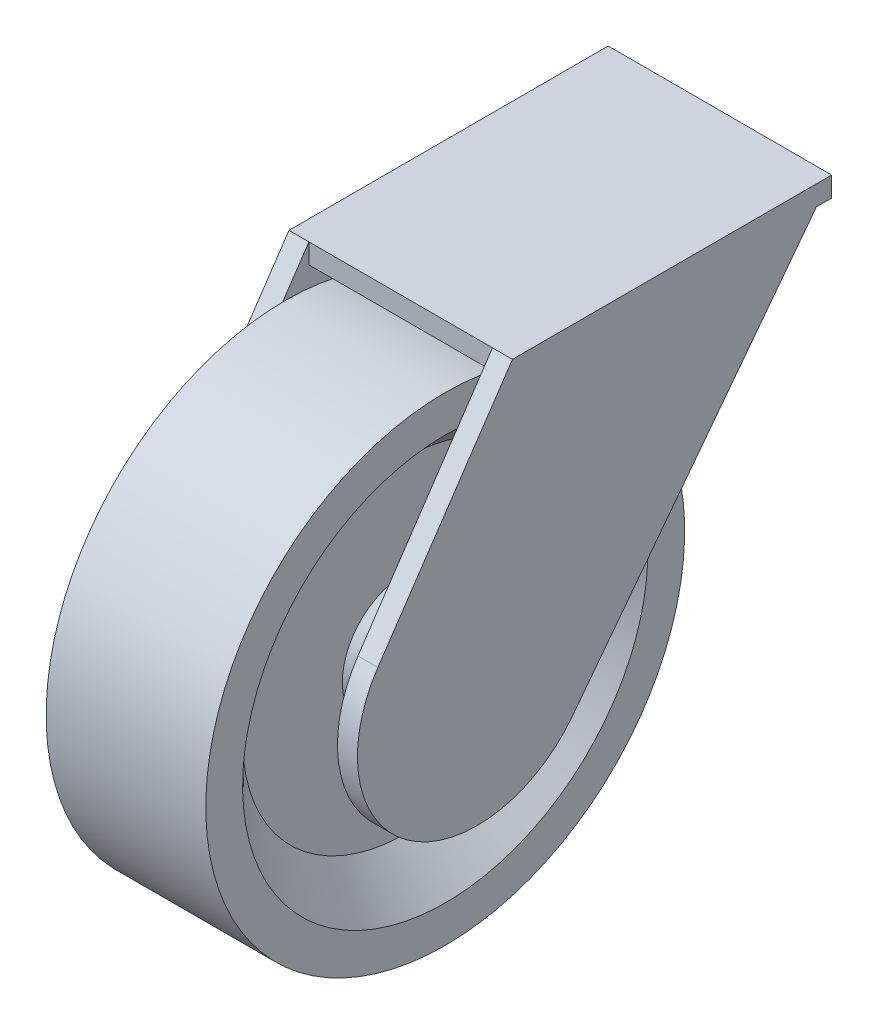
ISO-10303-21;
HEADER;
FILE_DESCRIPTION(('STEP AP214'),'2;1');
FILE_NAME('part.step','',(''),(''),'','','');
FILE_SCHEMA(('AUTOMOTIVE_DESIGN { 1 0 10303 214 1 1 1 1 }'));
ENDSEC;
DATA;
#1=APPLICATION_CONTEXT('core data for automotive mechanical design processes');
#2=APPLICATION_PROTOCOL_DEFINITION('international standard','automotive_design',2000,#1);
#3=PRODUCT_CONTEXT('',#1,'mechanical');
#4=PRODUCT('Part','Part','',(#3));
#5=PRODUCT_RELATED_PRODUCT_CATEGORY('part','',(#4));
#6=PRODUCT_DEFINITION_FORMATION('','',#4);
#7=PRODUCT_DEFINITION_CONTEXT('part definition',#1,'design');
#8=PRODUCT_DEFINITION('design','',#6,#7);
#9=PRODUCT_DEFINITION_SHAPE('','',#8);
#10=(LENGTH_UNIT() NAMED_UNIT(*) SI_UNIT(.MILLI.,.METRE.));
#11=(NAMED_UNIT(*) PLANE_ANGLE_UNIT() SI_UNIT($,.RADIAN.));
#12=(NAMED_UNIT(*) SI_UNIT($,.STERADIAN.) SOLID_ANGLE_UNIT());
#13=UNCERTAINTY_MEASURE_WITH_UNIT(LENGTH_MEASURE(1.E-05),#10,'distance_accuracy_value','');
#14=(GEOMETRIC_REPRESENTATION_CONTEXT(3) GLOBAL_UNCERTAINTY_ASSIGNED_CONTEXT((#13)) GLOBAL_UNIT_ASSIGNED_CONTEXT((#10,
#11,#12)) REPRESENTATION_CONTEXT('',''));
#15=CARTESIAN_POINT('',(0.,0.,0.));
#16=DIRECTION('',(0.,0.,1.));
#17=DIRECTION('',(1.,0.,0.));
#18=AXIS2_PLACEMENT_3D('',#15,#16,#17);
#19=CARTESIAN_POINT('',(3.00000000000001,66.7734196636378,-88.8457778702147));
#20=DIRECTION('',(0.,-0.607552677878739,-0.794279386363749));
#21=DIRECTION('',(0.,0.794279386363749,-0.607552677878739));
#22=AXIS2_PLACEMENT_3D('',#19,#20,#21);
#23=PLANE('',#22);
#24=DIRECTION('',(0.,0.794279386363749,-0.607552677878739));
#25=VECTOR('',#24,1.);
#26=CARTESIAN_POINT('',(3.00000000000001,66.7734196636378,-88.8457778702147));
#27=LINE('',#26,#25);
#28=CARTESIAN_POINT('',(3.,-18.2265803363622,-23.8283815909124));
#29=VERTEX_POINT('',#28);
#30=CARTESIAN_POINT('',(3.00000000000001,61.7734196636378,-85.0212251479028));
#31=VERTEX_POINT('',#30);
#32=EDGE_CURVE('E203',#29,#31,#27,.T.);
#33=ORIENTED_EDGE('',*,*,#32,.T.);
#34=DIRECTION('',(1.,0.,0.));
#35=VECTOR('',#34,1.);
#36=CARTESIAN_POINT('',(3.00000000000001,61.7734196636378,-85.0212251479028));
#37=LINE('',#36,#35);
#38=CARTESIAN_POINT('',(8.,61.7734196636378,-85.0212251479028));
#39=VERTEX_POINT('',#38);
#40=EDGE_CURVE('E160',#31,#39,#37,.T.);
#41=ORIENTED_EDGE('',*,*,#40,.T.);
#42=DIRECTION('',(0.,0.794279386363749,-0.607552677878739));
#43=VECTOR('',#42,1.);
#44=CARTESIAN_POINT('',(8.00000000000001,66.7734196636378,-88.8457778702147));
#45=LINE('',#44,#43);
#46=CARTESIAN_POINT('',(8.,-18.2265803363622,-23.8283815909124));
#47=VERTEX_POINT('',#46);
#48=EDGE_CURVE('E130',#47,#39,#45,.T.);
#49=ORIENTED_EDGE('',*,*,#48,.F.);
#50=DIRECTION('',(1.,0.,0.));
#51=VECTOR('',#50,1.);
#52=CARTESIAN_POINT('',(3.,-18.2265803363622,-23.8283815909124));
#53=LINE('',#52,#51);
#54=EDGE_CURVE('E217',#29,#47,#53,.T.);
#55=ORIENTED_EDGE('',*,*,#54,.F.);
#56=EDGE_LOOP('',(#33,#41,#49,#55));
#57=FACE_BOUND('',#56,.T.);
#58=ADVANCED_FACE('F38',(#57),#23,.T.);
#59=CARTESIAN_POINT('',(-43.,66.7734196636378,-88.8457778702147));
#60=DIRECTION('',(0.,0.607552677878739,0.794279386363749));
#61=DIRECTION('',(0.,-0.794279386363749,0.607552677878739));
#62=AXIS2_PLACEMENT_3D('',#59,#60,#61);
#63=PLANE('',#62);
#64=DIRECTION('',(-1.,0.,0.));
#65=VECTOR('',#64,1.);
#66=CARTESIAN_POINT('',(-43.,61.7734196636378,-85.0212251479028));
#67=LINE('',#66,#65);
#68=CARTESIAN_POINT('',(-43.,61.7734196636378,-85.0212251479028));
#69=VERTEX_POINT('',#68);
#70=CARTESIAN_POINT('',(-48.,61.7734196636378,-85.0212251479028));
#71=VERTEX_POINT('',#70);
#72=EDGE_CURVE('E61',#69,#71,#67,.T.);
#73=ORIENTED_EDGE('',*,*,#72,.F.);
#74=DIRECTION('',(0.,0.794279386363749,-0.607552677878739));
#75=VECTOR('',#74,1.);
#76=CARTESIAN_POINT('',(-43.,66.7734196636378,-88.8457778702147));
#77=LINE('',#76,#75);
#78=CARTESIAN_POINT('',(-43.,-18.2265803363622,-23.8283815909124));
#79=VERTEX_POINT('',#78);
#80=EDGE_CURVE('E171',#79,#69,#77,.T.);
#81=ORIENTED_EDGE('',*,*,#80,.F.);
#82=DIRECTION('',(-1.,0.,0.));
#83=VECTOR('',#82,1.);
#84=CARTESIAN_POINT('',(-43.,-18.2265803363622,-23.8283815909124));
#85=LINE('',#84,#83);
#86=CARTESIAN_POINT('',(-48.,-18.2265803363622,-23.8283815909124));
#87=VERTEX_POINT('',#86);
#88=EDGE_CURVE('E188',#79,#87,#85,.T.);
#89=ORIENTED_EDGE('',*,*,#88,.T.);
#90=DIRECTION('',(0.,0.794279386363749,-0.607552677878739));
#91=VECTOR('',#90,1.);
#92=CARTESIAN_POINT('',(-48.,66.7734196636378,-88.8457778702147));
#93=LINE('',#92,#91);
#94=EDGE_CURVE('E181',#87,#71,#93,.T.);
#95=ORIENTED_EDGE('',*,*,#94,.T.);
#96=EDGE_LOOP('',(#73,#81,#89,#95));
#97=FACE_BOUND('',#96,.T.);
#98=ADVANCED_FACE('F275',(#97),#63,.F.);
#99=CARTESIAN_POINT('',(-40.,60.,0.));
#100=DIRECTION('',(-1.,0.,0.));
#101=DIRECTION('',(0.,-1.,0.));
#102=AXIS2_PLACEMENT_3D('',#99,#100,#101);
#103=PLANE('',#102);
#104=CARTESIAN_POINT('',(-40.,0.,0.));
#105=DIRECTION('',(1.,0.,0.));
#106=DIRECTION('',(0.,1.,0.));
#107=AXIS2_PLACEMENT_3D('',#104,#105,#106);
#108=CIRCLE('',#107,50.7735026918962);
#109=CARTESIAN_POINT('',(-40.,50.7735026918962,0.));
#110=VERTEX_POINT('',#109);
#111=EDGE_CURVE('E223',#110,#110,#108,.T.);
#112=ORIENTED_EDGE('',*,*,#111,.T.);
#113=EDGE_LOOP('',(#112));
#114=FACE_BOUND('',#113,.T.);
#115=CARTESIAN_POINT('',(-40.,0.,0.));
#116=DIRECTION('',(1.,0.,0.));
#117=DIRECTION('',(0.,1.,0.));
#118=AXIS2_PLACEMENT_3D('',#115,#116,#117);
#119=CIRCLE('',#118,60.);
#120=CARTESIAN_POINT('',(-40.,60.,0.));
#121=VERTEX_POINT('',#120);
#122=EDGE_CURVE('E222',#121,#121,#119,.T.);
#123=ORIENTED_EDGE('',*,*,#122,.F.);
#124=EDGE_LOOP('',(#123));
#125=FACE_BOUND('',#124,.T.);
#126=ADVANCED_FACE('F40',(#114,#125),#103,.T.);
#127=CARTESIAN_POINT('',(0.,0.,0.));
#128=DIRECTION('',(1.,0.,0.));
#129=DIRECTION('',(0.,1.,0.));
#130=AXIS2_PLACEMENT_3D('',#127,#128,#129);
#131=CYLINDRICAL_SURFACE('',#130,60.);
#132=ORIENTED_EDGE('',*,*,#122,.T.);
#133=EDGE_LOOP('',(#132));
#134=FACE_BOUND('',#133,.T.);
#135=CARTESIAN_POINT('',(0.,0.,0.));
#136=DIRECTION('',(1.,0.,0.));
#137=DIRECTION('',(0.,1.,0.));
#138=AXIS2_PLACEMENT_3D('',#135,#136,#137);
#139=CIRCLE('',#138,60.);
#140=CARTESIAN_POINT('',(0.,60.,0.));
#141=VERTEX_POINT('',#140);
#142=EDGE_CURVE('E247',#141,#141,#139,.T.);
#143=ORIENTED_EDGE('',*,*,#142,.F.);
#144=EDGE_LOOP('',(#143));
#145=FACE_BOUND('',#144,.T.);
#146=ADVANCED_FACE('F323',(#134,#145),#131,.T.);
#147=CARTESIAN_POINT('',(0.,60.,0.));
#148=DIRECTION('',(1.,0.,0.));
#149=DIRECTION('',(0.,1.,0.));
#150=AXIS2_PLACEMENT_3D('',#147,#148,#149);
#151=PLANE('',#150);
#152=ORIENTED_EDGE('',*,*,#142,.T.);
#153=EDGE_LOOP('',(#152));
#154=FACE_BOUND('',#153,.T.);
#155=CARTESIAN_POINT('',(0.,0.,0.));
#156=DIRECTION('',(1.,0.,0.));
#157=DIRECTION('',(0.,1.,0.));
#158=AXIS2_PLACEMENT_3D('',#155,#156,#157);
#159=CIRCLE('',#158,50.7735026918962);
#160=CARTESIAN_POINT('',(0.,50.7735026918962,0.));
#161=VERTEX_POINT('',#160);
#162=EDGE_CURVE('E244',#161,#161,#159,.T.);
#163=ORIENTED_EDGE('',*,*,#162,.F.);
#164=EDGE_LOOP('',(#163));
#165=FACE_BOUND('',#164,.T.);
#166=ADVANCED_FACE('F320',(#154,#165),#151,.T.);
#167=CARTESIAN_POINT('',(-10.,0.,0.));
#168=DIRECTION('',(1.,0.,0.));
#169=DIRECTION('',(0.,1.,0.));
#170=AXIS2_PLACEMENT_3D('',#167,#168,#169);
#171=CONICAL_SURFACE('',#170,40.7735026918962,0.785398163397447);
#172=ORIENTED_EDGE('',*,*,#162,.T.);
#173=EDGE_LOOP('',(#172));
#174=FACE_BOUND('',#173,.T.);
#175=CARTESIAN_POINT('',(-10.,0.,0.));
#176=DIRECTION('',(1.,0.,0.));
#177=DIRECTION('',(0.,1.,0.));
#178=AXIS2_PLACEMENT_3D('',#175,#176,#177);
#179=CIRCLE('',#178,40.7735026918962);
#180=CARTESIAN_POINT('',(-10.,40.7735026918962,0.));
#181=VERTEX_POINT('',#180);
#182=EDGE_CURVE('E241',#181,#181,#179,.T.);
#183=ORIENTED_EDGE('',*,*,#182,.F.);
#184=EDGE_LOOP('',(#183));
#185=FACE_BOUND('',#184,.T.);
#186=ADVANCED_FACE('F316',(#174,#185),#171,.F.);
#187=CARTESIAN_POINT('',(-10.,40.7735026918962,0.));
#188=DIRECTION('',(1.,0.,0.));
#189=DIRECTION('',(0.,1.,0.));
#190=AXIS2_PLACEMENT_3D('',#187,#188,#189);
#191=PLANE('',#190);
#192=ORIENTED_EDGE('',*,*,#182,.T.);
#193=EDGE_LOOP('',(#192));
#194=FACE_BOUND('',#193,.T.);
#195=CARTESIAN_POINT('',(-10.,0.,0.));
#196=DIRECTION('',(1.,0.,0.));
#197=DIRECTION('',(0.,1.,0.));
#198=AXIS2_PLACEMENT_3D('',#195,#196,#197);
#199=CIRCLE('',#198,15.7735026918962);
#200=CARTESIAN_POINT('',(-10.,15.7735026918962,0.));
#201=VERTEX_POINT('',#200);
#202=EDGE_CURVE('E238',#201,#201,#199,.T.);
#203=ORIENTED_EDGE('',*,*,#202,.F.);
#204=EDGE_LOOP('',(#203));
#205=FACE_BOUND('',#204,.T.);
#206=ADVANCED_FACE('F312',(#194,#205),#191,.T.);
#207=CARTESIAN_POINT('',(0.,0.,0.));
#208=DIRECTION('',(-1.,0.,0.));
#209=DIRECTION('',(0.,-1.,0.));
#210=AXIS2_PLACEMENT_3D('',#207,#208,#209);
#211=CONICAL_SURFACE('',#210,10.,0.523598775598296);
#212=ORIENTED_EDGE('',*,*,#202,.T.);
#213=EDGE_LOOP('',(#212));
#214=FACE_BOUND('',#213,.T.);
#215=CARTESIAN_POINT('',(0.,0.,0.));
#216=DIRECTION('',(1.,0.,0.));
#217=DIRECTION('',(0.,1.,0.));
#218=AXIS2_PLACEMENT_3D('',#215,#216,#217);
#219=CIRCLE('',#218,10.);
#220=CARTESIAN_POINT('',(0.,10.,0.));
#221=VERTEX_POINT('',#220);
#222=EDGE_CURVE('E235',#221,#221,#219,.T.);
#223=ORIENTED_EDGE('',*,*,#222,.F.);
#224=EDGE_LOOP('',(#223));
#225=FACE_BOUND('',#224,.T.);
#226=ADVANCED_FACE('F308',(#214,#225),#211,.T.);
#227=CARTESIAN_POINT('',(0.,10.,0.));
#228=DIRECTION('',(1.,0.,0.));
#229=DIRECTION('',(0.,1.,0.));
#230=AXIS2_PLACEMENT_3D('',#227,#228,#229);
#231=PLANE('',#230);
#232=CARTESIAN_POINT('',(0.,0.,0.));
#233=DIRECTION('',(1.,0.,0.));
#234=DIRECTION('',(0.,1.,0.));
#235=AXIS2_PLACEMENT_3D('',#232,#233,#234);
#236=CIRCLE('',#235,7.5);
#237=CARTESIAN_POINT('',(0.,7.5,0.));
#238=VERTEX_POINT('',#237);
#239=EDGE_CURVE('E46',#238,#238,#236,.T.);
#240=ORIENTED_EDGE('',*,*,#239,.F.);
#241=EDGE_LOOP('',(#240));
#242=FACE_BOUND('',#241,.T.);
#243=ORIENTED_EDGE('',*,*,#222,.T.);
#244=EDGE_LOOP('',(#243));
#245=FACE_BOUND('',#244,.T.);
#246=ADVANCED_FACE('F304',(#242,#245),#231,.T.);
#247=CARTESIAN_POINT('',(-40.,10.,0.));
#248=DIRECTION('',(-1.,0.,0.));
#249=DIRECTION('',(0.,-1.,0.));
#250=AXIS2_PLACEMENT_3D('',#247,#248,#249);
#251=PLANE('',#250);
#252=CARTESIAN_POINT('',(-40.,0.,0.));
#253=DIRECTION('',(1.,0.,0.));
#254=DIRECTION('',(0.,1.,0.));
#255=AXIS2_PLACEMENT_3D('',#252,#253,#254);
#256=CIRCLE('',#255,7.5);
#257=CARTESIAN_POINT('',(-40.,7.50000000000001,0.));
#258=VERTEX_POINT('',#257);
#259=EDGE_CURVE('E187',#258,#258,#256,.T.);
#260=ORIENTED_EDGE('',*,*,#259,.T.);
#261=EDGE_LOOP('',(#260));
#262=FACE_BOUND('',#261,.T.);
#263=CARTESIAN_POINT('',(-40.,0.,0.));
#264=DIRECTION('',(1.,0.,0.));
#265=DIRECTION('',(0.,1.,0.));
#266=AXIS2_PLACEMENT_3D('',#263,#264,#265);
#267=CIRCLE('',#266,9.99999999999999);
#268=CARTESIAN_POINT('',(-40.,10.,0.));
#269=VERTEX_POINT('',#268);
#270=EDGE_CURVE('E232',#269,#269,#267,.T.);
#271=ORIENTED_EDGE('',*,*,#270,.F.);
#272=EDGE_LOOP('',(#271));
#273=FACE_BOUND('',#272,.T.);
#274=ADVANCED_FACE('F300',(#262,#273),#251,.T.);
#275=CARTESIAN_POINT('',(-30.,0.,0.));
#276=DIRECTION('',(1.,0.,0.));
#277=DIRECTION('',(0.,1.,0.));
#278=AXIS2_PLACEMENT_3D('',#275,#276,#277);
#279=CONICAL_SURFACE('',#278,15.7735026918962,0.523598775598296);
#280=ORIENTED_EDGE('',*,*,#270,.T.);
#281=EDGE_LOOP('',(#280));
#282=FACE_BOUND('',#281,.T.);
#283=CARTESIAN_POINT('',(-30.,0.,0.));
#284=DIRECTION('',(1.,0.,0.));
#285=DIRECTION('',(0.,1.,0.));
#286=AXIS2_PLACEMENT_3D('',#283,#284,#285);
#287=CIRCLE('',#286,15.7735026918962);
#288=CARTESIAN_POINT('',(-30.,15.7735026918962,0.));
#289=VERTEX_POINT('',#288);
#290=EDGE_CURVE('E229',#289,#289,#287,.T.);
#291=ORIENTED_EDGE('',*,*,#290,.F.);
#292=EDGE_LOOP('',(#291));
#293=FACE_BOUND('',#292,.T.);
#294=ADVANCED_FACE('F296',(#282,#293),#279,.T.);
#295=CARTESIAN_POINT('',(-30.,40.7735026918962,0.));
#296=DIRECTION('',(-1.,0.,0.));
#297=DIRECTION('',(0.,-1.,0.));
#298=AXIS2_PLACEMENT_3D('',#295,#296,#297);
#299=PLANE('',#298);
#300=ORIENTED_EDGE('',*,*,#290,.T.);
#301=EDGE_LOOP('',(#300));
#302=FACE_BOUND('',#301,.T.);
#303=CARTESIAN_POINT('',(-30.,0.,0.));
#304=DIRECTION('',(1.,0.,0.));
#305=DIRECTION('',(0.,1.,0.));
#306=AXIS2_PLACEMENT_3D('',#303,#304,#305);
#307=CIRCLE('',#306,40.7735026918962);
#308=CARTESIAN_POINT('',(-30.,40.7735026918962,0.));
#309=VERTEX_POINT('',#308);
#310=EDGE_CURVE('E226',#309,#309,#307,.T.);
#311=ORIENTED_EDGE('',*,*,#310,.F.);
#312=EDGE_LOOP('',(#311));
#313=FACE_BOUND('',#312,.T.);
#314=ADVANCED_FACE('F292',(#302,#313),#299,.T.);
#315=CARTESIAN_POINT('',(-40.,0.,0.));
#316=DIRECTION('',(-1.,0.,0.));
#317=DIRECTION('',(0.,-1.,0.));
#318=AXIS2_PLACEMENT_3D('',#315,#316,#317);
#319=CONICAL_SURFACE('',#318,50.7735026918962,0.785398163397447);
#320=ORIENTED_EDGE('',*,*,#310,.T.);
#321=EDGE_LOOP('',(#320));
#322=FACE_BOUND('',#321,.T.);
#323=ORIENTED_EDGE('',*,*,#111,.F.);
#324=EDGE_LOOP('',(#323));
#325=FACE_BOUND('',#324,.T.);
#326=ADVANCED_FACE('F289',(#322,#325),#319,.F.);
#327=CARTESIAN_POINT('',(8.,0.,0.));
#328=DIRECTION('',(-1.,0.,0.));
#329=DIRECTION('',(0.,-1.,0.));
#330=AXIS2_PLACEMENT_3D('',#327,#328,#329);
#331=CYLINDRICAL_SURFACE('',#330,7.5);
#332=CARTESIAN_POINT('',(3.,0.,0.));
#333=DIRECTION('',(-1.,0.,0.));
#334=DIRECTION('',(0.,-1.,0.));
#335=AXIS2_PLACEMENT_3D('',#332,#333,#334);
#336=CIRCLE('',#335,7.5);
#337=CARTESIAN_POINT('',(3.,-7.5,0.));
#338=VERTEX_POINT('',#337);
#339=EDGE_CURVE('E215',#338,#338,#336,.T.);
#340=ORIENTED_EDGE('',*,*,#339,.T.);
#341=EDGE_LOOP('',(#340));
#342=FACE_BOUND('',#341,.T.);
#343=ORIENTED_EDGE('',*,*,#239,.T.);
#344=EDGE_LOOP('',(#343));
#345=FACE_BOUND('',#344,.T.);
#346=ADVANCED_FACE('F254',(#342,#345),#331,.T.);
#347=CARTESIAN_POINT('',(3.,16.7734196636378,24.872723871492));
#348=DIRECTION('',(0.,0.559113988787928,0.8290907957164));
#349=DIRECTION('',(0.,-0.8290907957164,0.559113988787928));
#350=AXIS2_PLACEMENT_3D('',#347,#348,#349);
#351=PLANE('',#350);
#352=DIRECTION('',(0.,-0.8290907957164,0.559113988787928));
#353=VECTOR('',#352,1.);
#354=CARTESIAN_POINT('',(8.,16.7734196636378,24.872723871492));
#355=LINE('',#354,#353);
#356=CARTESIAN_POINT('',(8.00000000000001,66.7734196636378,-8.84577787021469));
#357=VERTEX_POINT('',#356);
#358=CARTESIAN_POINT('',(8.,16.7734196636378,24.872723871492));
#359=VERTEX_POINT('',#358);
#360=EDGE_CURVE('E195',#357,#359,#355,.T.);
#361=ORIENTED_EDGE('',*,*,#360,.F.);
#362=DIRECTION('',(1.,0.,0.));
#363=VECTOR('',#362,1.);
#364=CARTESIAN_POINT('',(3.00000000000001,66.7734196636378,-8.84577787021469));
#365=LINE('',#364,#363);
#366=CARTESIAN_POINT('',(3.00000000000001,66.7734196636378,-8.84577787021469));
#367=VERTEX_POINT('',#366);
#368=EDGE_CURVE('E213',#367,#357,#365,.T.);
#369=ORIENTED_EDGE('',*,*,#368,.F.);
#370=DIRECTION('',(0.,-0.8290907957164,0.559113988787928));
#371=VECTOR('',#370,1.);
#372=CARTESIAN_POINT('',(3.,16.7734196636378,24.872723871492));
#373=LINE('',#372,#371);
#374=CARTESIAN_POINT('',(3.,16.7734196636378,24.872723871492));
#375=VERTEX_POINT('',#374);
#376=EDGE_CURVE('E196',#367,#375,#373,.T.);
#377=ORIENTED_EDGE('',*,*,#376,.T.);
#378=DIRECTION('',(1.,0.,0.));
#379=VECTOR('',#378,1.);
#380=CARTESIAN_POINT('',(3.,16.7734196636378,24.872723871492));
#381=LINE('',#380,#379);
#382=EDGE_CURVE('E206',#375,#359,#381,.T.);
#383=ORIENTED_EDGE('',*,*,#382,.T.);
#384=EDGE_LOOP('',(#361,#369,#377,#383));
#385=FACE_BOUND('',#384,.T.);
#386=ADVANCED_FACE('F283',(#385),#351,.T.);
#387=CARTESIAN_POINT('',(3.00000000000001,66.7734196636378,-8.84577787021469));
#388=DIRECTION('',(0.,1.,0.));
#389=DIRECTION('',(-1.,0.,0.));
#390=AXIS2_PLACEMENT_3D('',#387,#388,#389);
#391=PLANE('',#390);
#392=DIRECTION('',(0.,0.,1.));
#393=VECTOR('',#392,1.);
#394=CARTESIAN_POINT('',(8.00000000000001,66.7734196636378,-8.84577787021469));
#395=LINE('',#394,#393);
#396=CARTESIAN_POINT('',(8.,66.7734196636378,-88.8457778702147));
#397=VERTEX_POINT('',#396);
#398=EDGE_CURVE('E200',#397,#357,#395,.T.);
#399=ORIENTED_EDGE('',*,*,#398,.F.);
#400=DIRECTION('',(1.,0.,0.));
#401=VECTOR('',#400,1.);
#402=CARTESIAN_POINT('',(3.00000000000001,66.7734196636378,-88.8457778702147));
#403=LINE('',#402,#401);
#404=CARTESIAN_POINT('',(-48.,66.7734196636378,-88.8457778702147));
#405=VERTEX_POINT('',#404);
#406=EDGE_CURVE('E141',#405,#397,#403,.T.);
#407=ORIENTED_EDGE('',*,*,#406,.F.);
#408=DIRECTION('',(0.,0.,1.));
#409=VECTOR('',#408,1.);
#410=CARTESIAN_POINT('',(-48.,66.7734196636378,-8.84577787021469));
#411=LINE('',#410,#409);
#412=CARTESIAN_POINT('',(-48.,66.7734196636378,-8.84577787021469));
#413=VERTEX_POINT('',#412);
#414=EDGE_CURVE('E179',#405,#413,#411,.T.);
#415=ORIENTED_EDGE('',*,*,#414,.T.);
#416=DIRECTION('',(-1.,0.,0.));
#417=VECTOR('',#416,1.);
#418=CARTESIAN_POINT('',(-43.,66.7734196636378,-8.84577787021469));
#419=LINE('',#418,#417);
#420=CARTESIAN_POINT('',(-43.,66.7734196636378,-8.84577787021469));
#421=VERTEX_POINT('',#420);
#422=EDGE_CURVE('E176',#421,#413,#419,.T.);
#423=ORIENTED_EDGE('',*,*,#422,.F.);
#424=DIRECTION('',(1.,0.,0.));
#425=VECTOR('',#424,1.);
#426=CARTESIAN_POINT('',(-48.,66.7734196636378,-8.84577787021469));
#427=LINE('',#426,#425);
#428=EDGE_CURVE('E152',#421,#367,#427,.T.);
#429=ORIENTED_EDGE('',*,*,#428,.T.);
#430=ORIENTED_EDGE('',*,*,#368,.T.);
#431=EDGE_LOOP('',(#399,#407,#415,#423,#429,#430));
#432=FACE_BOUND('',#431,.T.);
#433=ADVANCED_FACE('F268',(#432),#391,.T.);
#434=CARTESIAN_POINT('',(3.,0.,0.));
#435=DIRECTION('',(1.,0.,0.));
#436=DIRECTION('',(0.,1.,0.));
#437=AXIS2_PLACEMENT_3D('',#434,#435,#436);
#438=CYLINDRICAL_SURFACE('',#437,30.);
#439=CARTESIAN_POINT('',(8.,0.,0.));
#440=DIRECTION('',(1.,0.,0.));
#441=DIRECTION('',(0.,-1.,0.));
#442=AXIS2_PLACEMENT_3D('',#439,#440,#441);
#443=CIRCLE('',#442,30.);
#444=EDGE_CURVE('E209',#359,#47,#443,.T.);
#445=ORIENTED_EDGE('',*,*,#444,.F.);
#446=ORIENTED_EDGE('',*,*,#382,.F.);
#447=CARTESIAN_POINT('',(3.,0.,0.));
#448=DIRECTION('',(1.,0.,0.));
#449=DIRECTION('',(0.,-1.,0.));
#450=AXIS2_PLACEMENT_3D('',#447,#448,#449);
#451=CIRCLE('',#450,30.);
#452=EDGE_CURVE('E199',#375,#29,#451,.T.);
#453=ORIENTED_EDGE('',*,*,#452,.T.);
#454=ORIENTED_EDGE('',*,*,#54,.T.);
#455=EDGE_LOOP('',(#445,#446,#453,#454));
#456=FACE_BOUND('',#455,.T.);
#457=ADVANCED_FACE('F259',(#456),#438,.T.);
#458=CARTESIAN_POINT('',(3.,0.,0.));
#459=DIRECTION('',(-1.,0.,0.));
#460=DIRECTION('',(0.,-1.,0.));
#461=AXIS2_PLACEMENT_3D('',#458,#459,#460);
#462=PLANE('',#461);
#463=DIRECTION('',(0.,1.,0.));
#464=VECTOR('',#463,1.);
#465=CARTESIAN_POINT('',(3.,0.,-8.84577787021469));
#466=LINE('',#465,#464);
#467=CARTESIAN_POINT('',(3.00000000000001,61.7734196636378,-8.84577787021469));
#468=VERTEX_POINT('',#467);
#469=EDGE_CURVE('E164',#468,#367,#466,.T.);
#470=ORIENTED_EDGE('',*,*,#469,.F.);
#471=DIRECTION('',(0.,0.,-1.));
#472=VECTOR('',#471,1.);
#473=CARTESIAN_POINT('',(3.00000000000001,61.7734196636378,0.));
#474=LINE('',#473,#472);
#475=EDGE_CURVE('E157',#468,#31,#474,.T.);
#476=ORIENTED_EDGE('',*,*,#475,.T.);
#477=ORIENTED_EDGE('',*,*,#32,.F.);
#478=ORIENTED_EDGE('',*,*,#452,.F.);
#479=ORIENTED_EDGE('',*,*,#376,.F.);
#480=EDGE_LOOP('',(#470,#476,#477,#478,#479));
#481=FACE_BOUND('',#480,.T.);
#482=ORIENTED_EDGE('',*,*,#339,.F.);
#483=EDGE_LOOP('',(#482));
#484=FACE_BOUND('',#483,.T.);
#485=ADVANCED_FACE('F257',(#481,#484),#462,.T.);
#486=CARTESIAN_POINT('',(8.,0.,0.));
#487=DIRECTION('',(1.,0.,0.));
#488=DIRECTION('',(0.,1.,0.));
#489=AXIS2_PLACEMENT_3D('',#486,#487,#488);
#490=PLANE('',#489);
#491=ORIENTED_EDGE('',*,*,#398,.T.);
#492=ORIENTED_EDGE('',*,*,#360,.T.);
#493=ORIENTED_EDGE('',*,*,#444,.T.);
#494=ORIENTED_EDGE('',*,*,#48,.T.);
#495=DIRECTION('',(0.,0.,-1.));
#496=VECTOR('',#495,1.);
#497=CARTESIAN_POINT('',(8.,61.7734196636378,-88.8457778702147));
#498=LINE('',#497,#496);
#499=CARTESIAN_POINT('',(8.,61.7734196636378,-88.8457778702147));
#500=VERTEX_POINT('',#499);
#501=EDGE_CURVE('E122',#39,#500,#498,.T.);
#502=ORIENTED_EDGE('',*,*,#501,.T.);
#503=DIRECTION('',(0.,1.,0.));
#504=VECTOR('',#503,1.);
#505=CARTESIAN_POINT('',(8.,61.7734196636378,-88.8457778702147));
#506=LINE('',#505,#504);
#507=EDGE_CURVE('E126',#500,#397,#506,.T.);
#508=ORIENTED_EDGE('',*,*,#507,.T.);
#509=EDGE_LOOP('',(#491,#492,#493,#494,#502,#508));
#510=FACE_BOUND('',#509,.T.);
#511=ADVANCED_FACE('F125',(#510),#490,.T.);
#512=CARTESIAN_POINT('',(-48.,0.,0.));
#513=DIRECTION('',(1.,0.,0.));
#514=DIRECTION('',(0.,1.,0.));
#515=AXIS2_PLACEMENT_3D('',#512,#513,#514);
#516=CYLINDRICAL_SURFACE('',#515,7.5);
#517=CARTESIAN_POINT('',(-43.,0.,0.));
#518=DIRECTION('',(1.,0.,0.));
#519=DIRECTION('',(0.,1.,0.));
#520=AXIS2_PLACEMENT_3D('',#517,#518,#519);
#521=CIRCLE('',#520,7.5);
#522=CARTESIAN_POINT('',(-43.,7.50000000000001,0.));
#523=VERTEX_POINT('',#522);
#524=EDGE_CURVE('E11',#523,#523,#521,.F.);
#525=ORIENTED_EDGE('',*,*,#524,.F.);
#526=EDGE_LOOP('',(#525));
#527=FACE_BOUND('',#526,.T.);
#528=ORIENTED_EDGE('',*,*,#259,.F.);
#529=EDGE_LOOP('',(#528));
#530=FACE_BOUND('',#529,.T.);
#531=ADVANCED_FACE('F266',(#527,#530),#516,.T.);
#532=CARTESIAN_POINT('',(-43.,16.7734196636378,24.872723871492));
#533=DIRECTION('',(0.,-0.559113988787928,-0.8290907957164));
#534=DIRECTION('',(0.,0.8290907957164,-0.559113988787928));
#535=AXIS2_PLACEMENT_3D('',#532,#533,#534);
#536=PLANE('',#535);
#537=DIRECTION('',(0.,-0.8290907957164,0.559113988787928));
#538=VECTOR('',#537,1.);
#539=CARTESIAN_POINT('',(-48.,16.7734196636378,24.872723871492));
#540=LINE('',#539,#538);
#541=CARTESIAN_POINT('',(-48.,16.7734196636378,24.872723871492));
#542=VERTEX_POINT('',#541);
#543=EDGE_CURVE('E167',#413,#542,#540,.T.);
#544=ORIENTED_EDGE('',*,*,#543,.T.);
#545=DIRECTION('',(-1.,0.,0.));
#546=VECTOR('',#545,1.);
#547=CARTESIAN_POINT('',(-43.,16.7734196636378,24.872723871492));
#548=LINE('',#547,#546);
#549=CARTESIAN_POINT('',(-43.,16.7734196636378,24.872723871492));
#550=VERTEX_POINT('',#549);
#551=EDGE_CURVE('E184',#550,#542,#548,.T.);
#552=ORIENTED_EDGE('',*,*,#551,.F.);
#553=DIRECTION('',(0.,-0.8290907957164,0.559113988787928));
#554=VECTOR('',#553,1.);
#555=CARTESIAN_POINT('',(-43.,16.7734196636378,24.872723871492));
#556=LINE('',#555,#554);
#557=EDGE_CURVE('E168',#421,#550,#556,.T.);
#558=ORIENTED_EDGE('',*,*,#557,.F.);
#559=ORIENTED_EDGE('',*,*,#422,.T.);
#560=EDGE_LOOP('',(#544,#552,#558,#559));
#561=FACE_BOUND('',#560,.T.);
#562=ADVANCED_FACE('F471',(#561),#536,.F.);
#563=CARTESIAN_POINT('',(-43.,0.,0.));
#564=DIRECTION('',(-1.,0.,0.));
#565=DIRECTION('',(0.,-1.,0.));
#566=AXIS2_PLACEMENT_3D('',#563,#564,#565);
#567=CYLINDRICAL_SURFACE('',#566,30.);
#568=CARTESIAN_POINT('',(-48.,0.,0.));
#569=DIRECTION('',(1.,0.,0.));
#570=DIRECTION('',(0.,-1.,0.));
#571=AXIS2_PLACEMENT_3D('',#568,#569,#570);
#572=CIRCLE('',#571,30.);
#573=EDGE_CURVE('E172',#542,#87,#572,.T.);
#574=ORIENTED_EDGE('',*,*,#573,.T.);
#575=ORIENTED_EDGE('',*,*,#88,.F.);
#576=CARTESIAN_POINT('',(-43.,0.,0.));
#577=DIRECTION('',(1.,0.,0.));
#578=DIRECTION('',(0.,-1.,0.));
#579=AXIS2_PLACEMENT_3D('',#576,#577,#578);
#580=CIRCLE('',#579,30.);
#581=EDGE_CURVE('E174',#550,#79,#580,.T.);
#582=ORIENTED_EDGE('',*,*,#581,.F.);
#583=ORIENTED_EDGE('',*,*,#551,.T.);
#584=EDGE_LOOP('',(#574,#575,#582,#583));
#585=FACE_BOUND('',#584,.T.);
#586=ADVANCED_FACE('F367',(#585),#567,.T.);
#587=CARTESIAN_POINT('',(-43.,0.,0.));
#588=DIRECTION('',(1.,0.,0.));
#589=DIRECTION('',(0.,-1.,0.));
#590=AXIS2_PLACEMENT_3D('',#587,#588,#589);
#591=PLANE('',#590);
#592=DIRECTION('',(0.,-1.,0.));
#593=VECTOR('',#592,1.);
#594=CARTESIAN_POINT('',(-43.,0.,-8.84577787021469));
#595=LINE('',#594,#593);
#596=CARTESIAN_POINT('',(-43.,61.7734196636378,-8.84577787021469));
#597=VERTEX_POINT('',#596);
#598=EDGE_CURVE('E162',#421,#597,#595,.T.);
#599=ORIENTED_EDGE('',*,*,#598,.F.);
#600=ORIENTED_EDGE('',*,*,#557,.T.);
#601=ORIENTED_EDGE('',*,*,#581,.T.);
#602=ORIENTED_EDGE('',*,*,#80,.T.);
#603=DIRECTION('',(0.,0.,1.));
#604=VECTOR('',#603,1.);
#605=CARTESIAN_POINT('',(-43.,61.7734196636378,0.));
#606=LINE('',#605,#604);
#607=EDGE_CURVE('E53',#69,#597,#606,.T.);
#608=ORIENTED_EDGE('',*,*,#607,.T.);
#609=EDGE_LOOP('',(#599,#600,#601,#602,#608));
#610=FACE_BOUND('',#609,.T.);
#611=ORIENTED_EDGE('',*,*,#524,.T.);
#612=EDGE_LOOP('',(#611));
#613=FACE_BOUND('',#612,.T.);
#614=ADVANCED_FACE('F413',(#610,#613),#591,.T.);
#615=CARTESIAN_POINT('',(-48.,0.,0.));
#616=DIRECTION('',(-1.,0.,0.));
#617=DIRECTION('',(0.,1.,0.));
#618=AXIS2_PLACEMENT_3D('',#615,#616,#617);
#619=PLANE('',#618);
#620=ORIENTED_EDGE('',*,*,#543,.F.);
#621=ORIENTED_EDGE('',*,*,#414,.F.);
#622=DIRECTION('',(0.,1.,0.));
#623=VECTOR('',#622,1.);
#624=CARTESIAN_POINT('',(-48.,61.7734196636378,-88.8457778702147));
#625=LINE('',#624,#623);
#626=CARTESIAN_POINT('',(-48.,61.7734196636378,-88.8457778702147));
#627=VERTEX_POINT('',#626);
#628=EDGE_CURVE('E143',#627,#405,#625,.T.);
#629=ORIENTED_EDGE('',*,*,#628,.F.);
#630=DIRECTION('',(0.,0.,1.));
#631=VECTOR('',#630,1.);
#632=CARTESIAN_POINT('',(-48.,61.7734196636378,-88.8457778702147));
#633=LINE('',#632,#631);
#634=EDGE_CURVE('E148',#627,#71,#633,.T.);
#635=ORIENTED_EDGE('',*,*,#634,.T.);
#636=ORIENTED_EDGE('',*,*,#94,.F.);
#637=ORIENTED_EDGE('',*,*,#573,.F.);
#638=EDGE_LOOP('',(#620,#621,#629,#635,#636,#637));
#639=FACE_BOUND('',#638,.T.);
#640=ADVANCED_FACE('F418',(#639),#619,.T.);
#641=CARTESIAN_POINT('',(0.,61.7734196636378,0.));
#642=DIRECTION('',(0.,1.,0.));
#643=DIRECTION('',(0.,0.,1.));
#644=AXIS2_PLACEMENT_3D('',#641,#642,#643);
#645=PLANE('',#644);
#646=ORIENTED_EDGE('',*,*,#40,.F.);
#647=ORIENTED_EDGE('',*,*,#475,.F.);
#648=DIRECTION('',(1.,0.,0.));
#649=VECTOR('',#648,1.);
#650=CARTESIAN_POINT('',(-48.,61.7734196636378,-8.84577787021469));
#651=LINE('',#650,#649);
#652=EDGE_CURVE('E135',#597,#468,#651,.T.);
#653=ORIENTED_EDGE('',*,*,#652,.F.);
#654=ORIENTED_EDGE('',*,*,#607,.F.);
#655=ORIENTED_EDGE('',*,*,#72,.T.);
#656=ORIENTED_EDGE('',*,*,#634,.F.);
#657=DIRECTION('',(-1.,0.,0.));
#658=VECTOR('',#657,1.);
#659=CARTESIAN_POINT('',(-48.,61.7734196636378,-88.8457778702147));
#660=LINE('',#659,#658);
#661=EDGE_CURVE('E134',#500,#627,#660,.T.);
#662=ORIENTED_EDGE('',*,*,#661,.F.);
#663=ORIENTED_EDGE('',*,*,#501,.F.);
#664=EDGE_LOOP('',(#646,#647,#653,#654,#655,#656,#662,#663));
#665=FACE_BOUND('',#664,.T.);
#666=ADVANCED_FACE('F146',(#665),#645,.F.);
#667=CARTESIAN_POINT('',(-48.,61.7734196636378,-88.8457778702147));
#668=DIRECTION('',(0.,0.,-1.));
#669=DIRECTION('',(-1.,0.,0.));
#670=AXIS2_PLACEMENT_3D('',#667,#668,#669);
#671=PLANE('',#670);
#672=ORIENTED_EDGE('',*,*,#406,.T.);
#673=ORIENTED_EDGE('',*,*,#507,.F.);
#674=ORIENTED_EDGE('',*,*,#661,.T.);
#675=ORIENTED_EDGE('',*,*,#628,.T.);
#676=EDGE_LOOP('',(#672,#673,#674,#675));
#677=FACE_BOUND('',#676,.T.);
#678=ADVANCED_FACE('F139',(#677),#671,.T.);
#679=CARTESIAN_POINT('',(-48.,61.7734196636378,-8.84577787021469));
#680=DIRECTION('',(0.,0.,1.));
#681=DIRECTION('',(1.,0.,0.));
#682=AXIS2_PLACEMENT_3D('',#679,#680,#681);
#683=PLANE('',#682);
#684=ORIENTED_EDGE('',*,*,#652,.T.);
#685=ORIENTED_EDGE('',*,*,#469,.T.);
#686=ORIENTED_EDGE('',*,*,#428,.F.);
#687=ORIENTED_EDGE('',*,*,#598,.T.);
#688=EDGE_LOOP('',(#684,#685,#686,#687));
#689=FACE_BOUND('',#688,.T.);
#690=ADVANCED_FACE('F447',(#689),#683,.T.);
#691=CLOSED_SHELL('',(#58,#98,#126,#146,#166,#186,#206,#226,#246,#274,#294,#314,#326,#346,#386,
#433,#457,#485,#511,#531,#562,#586,#614,#640,#666,#678,#690));
#692=MANIFOLD_SOLID_BREP('B2',#691);
#693=ADVANCED_BREP_SHAPE_REPRESENTATION('',(#18,#692),#14);
#694=SHAPE_DEFINITION_REPRESENTATION(#9,#693);
ENDSEC;
END-ISO-10303-21;
